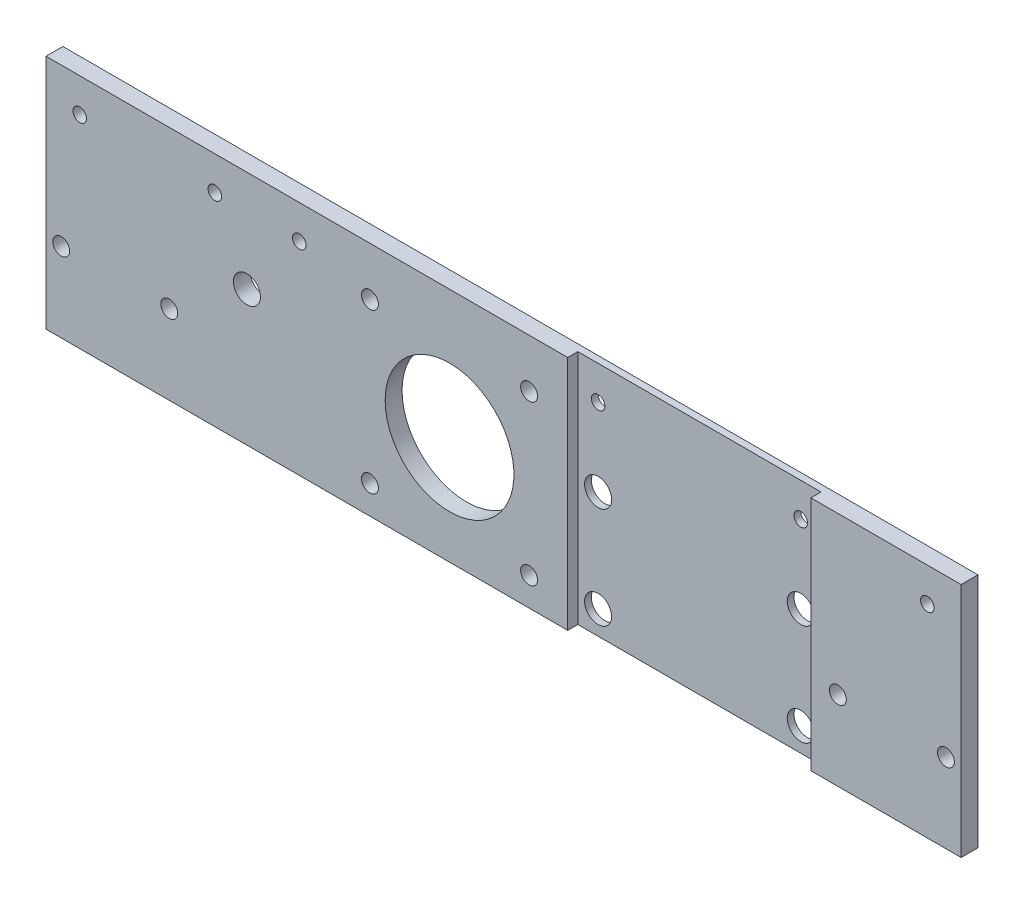
ISO-10303-21;
HEADER;
FILE_DESCRIPTION(('STEP AP214'),'2;1');
FILE_NAME('part.step','',(''),(''),'','','');
FILE_SCHEMA(('AUTOMOTIVE_DESIGN { 1 0 10303 214 1 1 1 1 }'));
ENDSEC;
DATA;
#1=APPLICATION_CONTEXT('core data for automotive mechanical design processes');
#2=APPLICATION_PROTOCOL_DEFINITION('international standard','automotive_design',2000,#1);
#3=PRODUCT_CONTEXT('',#1,'mechanical');
#4=PRODUCT('Part','Part','',(#3));
#5=PRODUCT_RELATED_PRODUCT_CATEGORY('part','',(#4));
#6=PRODUCT_DEFINITION_FORMATION('','',#4);
#7=PRODUCT_DEFINITION_CONTEXT('part definition',#1,'design');
#8=PRODUCT_DEFINITION('design','',#6,#7);
#9=PRODUCT_DEFINITION_SHAPE('','',#8);
#10=(LENGTH_UNIT() NAMED_UNIT(*) SI_UNIT(.MILLI.,.METRE.));
#11=(NAMED_UNIT(*) PLANE_ANGLE_UNIT() SI_UNIT($,.RADIAN.));
#12=(NAMED_UNIT(*) SI_UNIT($,.STERADIAN.) SOLID_ANGLE_UNIT());
#13=UNCERTAINTY_MEASURE_WITH_UNIT(LENGTH_MEASURE(1.E-05),#10,'distance_accuracy_value','');
#14=(GEOMETRIC_REPRESENTATION_CONTEXT(3) GLOBAL_UNCERTAINTY_ASSIGNED_CONTEXT((#13)) GLOBAL_UNIT_ASSIGNED_CONTEXT((#10,
#11,#12)) REPRESENTATION_CONTEXT('',''));
#15=CARTESIAN_POINT('',(0.,0.,0.));
#16=DIRECTION('',(0.,0.,1.));
#17=DIRECTION('',(1.,0.,0.));
#18=AXIS2_PLACEMENT_3D('',#15,#16,#17);
#19=CARTESIAN_POINT('',(0.,0.,5.));
#20=DIRECTION('',(0.,0.,-1.));
#21=DIRECTION('',(-1.,0.,0.));
#22=AXIS2_PLACEMENT_3D('',#19,#20,#21);
#23=PLANE('',#22);
#24=CARTESIAN_POINT('',(75.,60.,5.));
#25=DIRECTION('',(0.,0.,1.));
#26=DIRECTION('',(1.,0.,0.));
#27=AXIS2_PLACEMENT_3D('',#24,#25,#26);
#28=CIRCLE('',#27,2.);
#29=CARTESIAN_POINT('',(77.,60.,5.));
#30=VERTEX_POINT('',#29);
#31=EDGE_CURVE('E378',#30,#30,#28,.T.);
#32=ORIENTED_EDGE('',*,*,#31,.F.);
#33=EDGE_LOOP('',(#32));
#34=FACE_BOUND('',#33,.T.);
#35=CARTESIAN_POINT('',(59.5,40.,5.));
#36=DIRECTION('',(0.,0.,-1.));
#37=DIRECTION('',(-1.,0.,0.));
#38=AXIS2_PLACEMENT_3D('',#35,#36,#37);
#39=CIRCLE('',#38,4.00000000000001);
#40=CARTESIAN_POINT('',(55.5,40.,5.));
#41=VERTEX_POINT('',#40);
#42=EDGE_CURVE('E384',#41,#41,#39,.T.);
#43=ORIENTED_EDGE('',*,*,#42,.T.);
#44=EDGE_LOOP('',(#43));
#45=FACE_BOUND('',#44,.T.);
#46=CARTESIAN_POINT('',(143.07,55.57,5.));
#47=DIRECTION('',(0.,0.,-1.));
#48=DIRECTION('',(-1.,0.,0.));
#49=AXIS2_PLACEMENT_3D('',#46,#47,#48);
#50=CIRCLE('',#49,2.5);
#51=CARTESIAN_POINT('',(140.57,55.57,5.));
#52=VERTEX_POINT('',#51);
#53=EDGE_CURVE('E390',#52,#52,#50,.T.);
#54=ORIENTED_EDGE('',*,*,#53,.T.);
#55=EDGE_LOOP('',(#54));
#56=FACE_BOUND('',#55,.T.);
#57=CARTESIAN_POINT('',(95.93,55.57,5.));
#58=DIRECTION('',(0.,0.,-1.));
#59=DIRECTION('',(-1.,0.,0.));
#60=AXIS2_PLACEMENT_3D('',#57,#58,#59);
#61=CIRCLE('',#60,2.50000000000001);
#62=CARTESIAN_POINT('',(93.43,55.57,5.));
#63=VERTEX_POINT('',#62);
#64=EDGE_CURVE('E396',#63,#63,#61,.T.);
#65=ORIENTED_EDGE('',*,*,#64,.T.);
#66=EDGE_LOOP('',(#65));
#67=FACE_BOUND('',#66,.T.);
#68=CARTESIAN_POINT('',(143.07,8.43,5.));
#69=DIRECTION('',(0.,0.,-1.));
#70=DIRECTION('',(-1.,0.,0.));
#71=AXIS2_PLACEMENT_3D('',#68,#69,#70);
#72=CIRCLE('',#71,2.5);
#73=CARTESIAN_POINT('',(140.57,8.43,5.));
#74=VERTEX_POINT('',#73);
#75=EDGE_CURVE('E402',#74,#74,#72,.T.);
#76=ORIENTED_EDGE('',*,*,#75,.T.);
#77=EDGE_LOOP('',(#76));
#78=FACE_BOUND('',#77,.T.);
#79=CARTESIAN_POINT('',(95.93,8.43,5.));
#80=DIRECTION('',(0.,0.,-1.));
#81=DIRECTION('',(-1.,0.,0.));
#82=AXIS2_PLACEMENT_3D('',#79,#80,#81);
#83=CIRCLE('',#82,2.49999999999999);
#84=CARTESIAN_POINT('',(93.43,8.43,5.));
#85=VERTEX_POINT('',#84);
#86=EDGE_CURVE('E408',#85,#85,#83,.T.);
#87=ORIENTED_EDGE('',*,*,#86,.T.);
#88=EDGE_LOOP('',(#87));
#89=FACE_BOUND('',#88,.T.);
#90=CARTESIAN_POINT('',(119.5,32.,5.));
#91=DIRECTION('',(0.,0.,-1.));
#92=DIRECTION('',(-1.,0.,0.));
#93=AXIS2_PLACEMENT_3D('',#90,#91,#92);
#94=CIRCLE('',#93,19.0625);
#95=CARTESIAN_POINT('',(100.4375,32.,5.));
#96=VERTEX_POINT('',#95);
#97=EDGE_CURVE('E414',#96,#96,#94,.T.);
#98=ORIENTED_EDGE('',*,*,#97,.T.);
#99=EDGE_LOOP('',(#98));
#100=FACE_BOUND('',#99,.T.);
#101=CARTESIAN_POINT('',(50.,60.,5.));
#102=DIRECTION('',(0.,0.,-1.));
#103=DIRECTION('',(-1.,0.,0.));
#104=AXIS2_PLACEMENT_3D('',#101,#102,#103);
#105=CIRCLE('',#104,2.);
#106=CARTESIAN_POINT('',(48.,60.,5.));
#107=VERTEX_POINT('',#106);
#108=EDGE_CURVE('E205',#107,#107,#105,.T.);
#109=ORIENTED_EDGE('',*,*,#108,.T.);
#110=EDGE_LOOP('',(#109));
#111=FACE_BOUND('',#110,.T.);
#112=CARTESIAN_POINT('',(10.,60.,5.));
#113=DIRECTION('',(0.,0.,-1.));
#114=DIRECTION('',(-1.,0.,0.));
#115=AXIS2_PLACEMENT_3D('',#112,#113,#114);
#116=CIRCLE('',#115,2.);
#117=CARTESIAN_POINT('',(8.00000000000001,60.,5.));
#118=VERTEX_POINT('',#117);
#119=EDGE_CURVE('E211',#118,#118,#116,.T.);
#120=ORIENTED_EDGE('',*,*,#119,.T.);
#121=EDGE_LOOP('',(#120));
#122=FACE_BOUND('',#121,.T.);
#123=CARTESIAN_POINT('',(4.5,23.5,5.));
#124=DIRECTION('',(0.,0.,-1.));
#125=DIRECTION('',(-1.,0.,0.));
#126=AXIS2_PLACEMENT_3D('',#123,#124,#125);
#127=CIRCLE('',#126,2.5);
#128=CARTESIAN_POINT('',(2.,23.5,5.));
#129=VERTEX_POINT('',#128);
#130=EDGE_CURVE('E217',#129,#129,#127,.T.);
#131=ORIENTED_EDGE('',*,*,#130,.T.);
#132=EDGE_LOOP('',(#131));
#133=FACE_BOUND('',#132,.T.);
#134=CARTESIAN_POINT('',(36.5,23.5,5.));
#135=DIRECTION('',(0.,0.,-1.));
#136=DIRECTION('',(-1.,0.,0.));
#137=AXIS2_PLACEMENT_3D('',#134,#135,#136);
#138=CIRCLE('',#137,2.5);
#139=CARTESIAN_POINT('',(34.,23.5,5.));
#140=VERTEX_POINT('',#139);
#141=EDGE_CURVE('E223',#140,#140,#138,.T.);
#142=ORIENTED_EDGE('',*,*,#141,.T.);
#143=EDGE_LOOP('',(#142));
#144=FACE_BOUND('',#143,.T.);
#145=DIRECTION('',(1.,0.,0.));
#146=VECTOR('',#145,1.);
#147=CARTESIAN_POINT('',(0.,0.,5.));
#148=LINE('',#147,#146);
#149=CARTESIAN_POINT('',(0.,0.,5.));
#150=VERTEX_POINT('',#149);
#151=CARTESIAN_POINT('',(154.5,0.,5.));
#152=VERTEX_POINT('',#151);
#153=EDGE_CURVE('E88',#150,#152,#148,.T.);
#154=ORIENTED_EDGE('',*,*,#153,.T.);
#155=DIRECTION('',(0.,-1.,0.));
#156=VECTOR('',#155,1.);
#157=CARTESIAN_POINT('',(154.5,70.,5.));
#158=LINE('',#157,#156);
#159=CARTESIAN_POINT('',(154.5,70.,5.));
#160=VERTEX_POINT('',#159);
#161=EDGE_CURVE('E114',#160,#152,#158,.T.);
#162=ORIENTED_EDGE('',*,*,#161,.F.);
#163=DIRECTION('',(-1.,0.,0.));
#164=VECTOR('',#163,1.);
#165=CARTESIAN_POINT('',(0.,70.,5.));
#166=LINE('',#165,#164);
#167=CARTESIAN_POINT('',(0.,70.,5.));
#168=VERTEX_POINT('',#167);
#169=EDGE_CURVE('E59',#160,#168,#166,.T.);
#170=ORIENTED_EDGE('',*,*,#169,.T.);
#171=DIRECTION('',(0.,-1.,0.));
#172=VECTOR('',#171,1.);
#173=CARTESIAN_POINT('',(0.,0.,5.));
#174=LINE('',#173,#172);
#175=EDGE_CURVE('E145',#168,#150,#174,.T.);
#176=ORIENTED_EDGE('',*,*,#175,.T.);
#177=EDGE_LOOP('',(#154,#162,#170,#176));
#178=FACE_BOUND('',#177,.T.);
#179=ADVANCED_FACE('F33',(#34,#45,#56,#67,#78,#89,#100,#111,#122,#133,#144,#178),#23,.F.);
#180=CARTESIAN_POINT('',(0.,0.,5.));
#181=DIRECTION('',(1.,0.,0.));
#182=DIRECTION('',(0.,0.,-1.));
#183=AXIS2_PLACEMENT_3D('',#180,#181,#182);
#184=PLANE('',#183);
#185=DIRECTION('',(0.,-1.,0.));
#186=VECTOR('',#185,1.);
#187=CARTESIAN_POINT('',(0.,0.,0.));
#188=LINE('',#187,#186);
#189=CARTESIAN_POINT('',(0.,70.,0.));
#190=VERTEX_POINT('',#189);
#191=CARTESIAN_POINT('',(0.,0.,0.));
#192=VERTEX_POINT('',#191);
#193=EDGE_CURVE('E140',#190,#192,#188,.T.);
#194=ORIENTED_EDGE('',*,*,#193,.T.);
#195=DIRECTION('',(0.,0.,-1.));
#196=VECTOR('',#195,1.);
#197=CARTESIAN_POINT('',(0.,0.,5.));
#198=LINE('',#197,#196);
#199=EDGE_CURVE('E11',#150,#192,#198,.T.);
#200=ORIENTED_EDGE('',*,*,#199,.F.);
#201=ORIENTED_EDGE('',*,*,#175,.F.);
#202=DIRECTION('',(0.,0.,-1.));
#203=VECTOR('',#202,1.);
#204=CARTESIAN_POINT('',(0.,70.,5.));
#205=LINE('',#204,#203);
#206=EDGE_CURVE('E154',#168,#190,#205,.T.);
#207=ORIENTED_EDGE('',*,*,#206,.T.);
#208=EDGE_LOOP('',(#194,#200,#201,#207));
#209=FACE_BOUND('',#208,.T.);
#210=ADVANCED_FACE('F35',(#209),#184,.F.);
#211=CARTESIAN_POINT('',(0.,0.,5.));
#212=DIRECTION('',(0.,1.,0.));
#213=DIRECTION('',(0.,0.,1.));
#214=AXIS2_PLACEMENT_3D('',#211,#212,#213);
#215=PLANE('',#214);
#216=DIRECTION('',(1.,0.,0.));
#217=VECTOR('',#216,1.);
#218=CARTESIAN_POINT('',(154.5,0.,2.));
#219=LINE('',#218,#217);
#220=CARTESIAN_POINT('',(154.5,0.,2.));
#221=VERTEX_POINT('',#220);
#222=CARTESIAN_POINT('',(226.5,0.,2.));
#223=VERTEX_POINT('',#222);
#224=EDGE_CURVE('E122',#221,#223,#219,.T.);
#225=ORIENTED_EDGE('',*,*,#224,.F.);
#226=DIRECTION('',(0.,0.,1.));
#227=VECTOR('',#226,1.);
#228=CARTESIAN_POINT('',(154.5,0.,2.));
#229=LINE('',#228,#227);
#230=EDGE_CURVE('E109',#221,#152,#229,.T.);
#231=ORIENTED_EDGE('',*,*,#230,.T.);
#232=ORIENTED_EDGE('',*,*,#153,.F.);
#233=ORIENTED_EDGE('',*,*,#199,.T.);
#234=DIRECTION('',(1.,0.,0.));
#235=VECTOR('',#234,1.);
#236=CARTESIAN_POINT('',(0.,0.,0.));
#237=LINE('',#236,#235);
#238=CARTESIAN_POINT('',(271.,0.,0.));
#239=VERTEX_POINT('',#238);
#240=EDGE_CURVE('E157',#192,#239,#237,.T.);
#241=ORIENTED_EDGE('',*,*,#240,.T.);
#242=DIRECTION('',(0.,0.,-1.));
#243=VECTOR('',#242,1.);
#244=CARTESIAN_POINT('',(271.,0.,5.));
#245=LINE('',#244,#243);
#246=CARTESIAN_POINT('',(271.,0.,5.));
#247=VERTEX_POINT('',#246);
#248=EDGE_CURVE('E42',#247,#239,#245,.T.);
#249=ORIENTED_EDGE('',*,*,#248,.F.);
#250=CARTESIAN_POINT('',(226.5,0.,5.));
#251=VERTEX_POINT('',#250);
#252=EDGE_CURVE('E147',#251,#247,#148,.T.);
#253=ORIENTED_EDGE('',*,*,#252,.F.);
#254=DIRECTION('',(0.,0.,1.));
#255=VECTOR('',#254,1.);
#256=CARTESIAN_POINT('',(226.5,0.,2.));
#257=LINE('',#256,#255);
#258=EDGE_CURVE('E50',#223,#251,#257,.T.);
#259=ORIENTED_EDGE('',*,*,#258,.F.);
#260=EDGE_LOOP('',(#225,#231,#232,#233,#241,#249,#253,#259));
#261=FACE_BOUND('',#260,.T.);
#262=ADVANCED_FACE('F127',(#261),#215,.F.);
#263=CARTESIAN_POINT('',(271.,0.,5.));
#264=DIRECTION('',(-1.,0.,0.));
#265=DIRECTION('',(0.,0.,1.));
#266=AXIS2_PLACEMENT_3D('',#263,#264,#265);
#267=PLANE('',#266);
#268=DIRECTION('',(0.,1.,0.));
#269=VECTOR('',#268,1.);
#270=CARTESIAN_POINT('',(271.,0.,0.));
#271=LINE('',#270,#269);
#272=CARTESIAN_POINT('',(271.,70.,0.));
#273=VERTEX_POINT('',#272);
#274=EDGE_CURVE('E159',#239,#273,#271,.T.);
#275=ORIENTED_EDGE('',*,*,#274,.T.);
#276=DIRECTION('',(0.,0.,-1.));
#277=VECTOR('',#276,1.);
#278=CARTESIAN_POINT('',(271.,70.,5.));
#279=LINE('',#278,#277);
#280=CARTESIAN_POINT('',(271.,70.,5.));
#281=VERTEX_POINT('',#280);
#282=EDGE_CURVE('E163',#281,#273,#279,.T.);
#283=ORIENTED_EDGE('',*,*,#282,.F.);
#284=DIRECTION('',(0.,1.,0.));
#285=VECTOR('',#284,1.);
#286=CARTESIAN_POINT('',(271.,0.,5.));
#287=LINE('',#286,#285);
#288=EDGE_CURVE('E149',#247,#281,#287,.T.);
#289=ORIENTED_EDGE('',*,*,#288,.F.);
#290=ORIENTED_EDGE('',*,*,#248,.T.);
#291=EDGE_LOOP('',(#275,#283,#289,#290));
#292=FACE_BOUND('',#291,.T.);
#293=ADVANCED_FACE('F274',(#292),#267,.F.);
#294=CARTESIAN_POINT('',(0.,70.,5.));
#295=DIRECTION('',(0.,-1.,0.));
#296=DIRECTION('',(0.,0.,-1.));
#297=AXIS2_PLACEMENT_3D('',#294,#295,#296);
#298=PLANE('',#297);
#299=ORIENTED_EDGE('',*,*,#169,.F.);
#300=DIRECTION('',(0.,0.,1.));
#301=VECTOR('',#300,1.);
#302=CARTESIAN_POINT('',(154.5,70.,2.));
#303=LINE('',#302,#301);
#304=CARTESIAN_POINT('',(154.5,70.,2.));
#305=VERTEX_POINT('',#304);
#306=EDGE_CURVE('E138',#305,#160,#303,.T.);
#307=ORIENTED_EDGE('',*,*,#306,.F.);
#308=DIRECTION('',(-1.,0.,0.));
#309=VECTOR('',#308,1.);
#310=CARTESIAN_POINT('',(154.5,70.,2.));
#311=LINE('',#310,#309);
#312=CARTESIAN_POINT('',(226.5,70.,2.));
#313=VERTEX_POINT('',#312);
#314=EDGE_CURVE('E116',#313,#305,#311,.T.);
#315=ORIENTED_EDGE('',*,*,#314,.F.);
#316=DIRECTION('',(0.,0.,1.));
#317=VECTOR('',#316,1.);
#318=CARTESIAN_POINT('',(226.5,70.,2.));
#319=LINE('',#318,#317);
#320=CARTESIAN_POINT('',(226.5,70.,5.));
#321=VERTEX_POINT('',#320);
#322=EDGE_CURVE('E141',#313,#321,#319,.T.);
#323=ORIENTED_EDGE('',*,*,#322,.T.);
#324=EDGE_CURVE('E151',#281,#321,#166,.T.);
#325=ORIENTED_EDGE('',*,*,#324,.F.);
#326=ORIENTED_EDGE('',*,*,#282,.T.);
#327=DIRECTION('',(-1.,0.,0.));
#328=VECTOR('',#327,1.);
#329=CARTESIAN_POINT('',(0.,70.,0.));
#330=LINE('',#329,#328);
#331=EDGE_CURVE('E81',#273,#190,#330,.T.);
#332=ORIENTED_EDGE('',*,*,#331,.T.);
#333=ORIENTED_EDGE('',*,*,#206,.F.);
#334=EDGE_LOOP('',(#299,#307,#315,#323,#325,#326,#332,#333));
#335=FACE_BOUND('',#334,.T.);
#336=ADVANCED_FACE('F259',(#335),#298,.F.);
#337=CARTESIAN_POINT('',(261.,60.,5.));
#338=DIRECTION('',(0.,0.,-1.));
#339=DIRECTION('',(-1.,0.,0.));
#340=AXIS2_PLACEMENT_3D('',#337,#338,#339);
#341=CIRCLE('',#340,2.);
#342=CARTESIAN_POINT('',(259.,60.,5.));
#343=VERTEX_POINT('',#342);
#344=EDGE_CURVE('E194',#343,#343,#341,.T.);
#345=ORIENTED_EDGE('',*,*,#344,.T.);
#346=EDGE_LOOP('',(#345));
#347=FACE_BOUND('',#346,.T.);
#348=CARTESIAN_POINT('',(266.5,23.5,5.));
#349=DIRECTION('',(0.,0.,-1.));
#350=DIRECTION('',(-1.,0.,0.));
#351=AXIS2_PLACEMENT_3D('',#348,#349,#350);
#352=CIRCLE('',#351,2.50000000000002);
#353=CARTESIAN_POINT('',(264.,23.5,5.));
#354=VERTEX_POINT('',#353);
#355=EDGE_CURVE('E229',#354,#354,#352,.T.);
#356=ORIENTED_EDGE('',*,*,#355,.T.);
#357=EDGE_LOOP('',(#356));
#358=FACE_BOUND('',#357,.T.);
#359=CARTESIAN_POINT('',(234.5,23.5,5.));
#360=DIRECTION('',(0.,0.,-1.));
#361=DIRECTION('',(-1.,0.,0.));
#362=AXIS2_PLACEMENT_3D('',#359,#360,#361);
#363=CIRCLE('',#362,2.5);
#364=CARTESIAN_POINT('',(232.,23.5,5.));
#365=VERTEX_POINT('',#364);
#366=EDGE_CURVE('E235',#365,#365,#363,.T.);
#367=ORIENTED_EDGE('',*,*,#366,.T.);
#368=EDGE_LOOP('',(#367));
#369=FACE_BOUND('',#368,.T.);
#370=ORIENTED_EDGE('',*,*,#324,.T.);
#371=DIRECTION('',(0.,1.,0.));
#372=VECTOR('',#371,1.);
#373=CARTESIAN_POINT('',(226.5,70.,5.));
#374=LINE('',#373,#372);
#375=EDGE_CURVE('E125',#251,#321,#374,.T.);
#376=ORIENTED_EDGE('',*,*,#375,.F.);
#377=ORIENTED_EDGE('',*,*,#252,.T.);
#378=ORIENTED_EDGE('',*,*,#288,.T.);
#379=EDGE_LOOP('',(#370,#376,#377,#378));
#380=FACE_BOUND('',#379,.T.);
#381=ADVANCED_FACE('F251',(#347,#358,#369,#380),#23,.F.);
#382=CARTESIAN_POINT('',(0.,0.,0.));
#383=DIRECTION('',(0.,0.,-1.));
#384=DIRECTION('',(-1.,0.,0.));
#385=AXIS2_PLACEMENT_3D('',#382,#383,#384);
#386=PLANE('',#385);
#387=CARTESIAN_POINT('',(75.,60.,0.));
#388=DIRECTION('',(0.,0.,-1.));
#389=DIRECTION('',(-1.,0.,0.));
#390=AXIS2_PLACEMENT_3D('',#387,#388,#389);
#391=CIRCLE('',#390,2.);
#392=CARTESIAN_POINT('',(73.,60.,0.));
#393=VERTEX_POINT('',#392);
#394=EDGE_CURVE('E37',#393,#393,#391,.T.);
#395=ORIENTED_EDGE('',*,*,#394,.F.);
#396=EDGE_LOOP('',(#395));
#397=FACE_BOUND('',#396,.T.);
#398=CARTESIAN_POINT('',(59.5,40.,0.));
#399=DIRECTION('',(0.,0.,-1.));
#400=DIRECTION('',(-1.,0.,0.));
#401=AXIS2_PLACEMENT_3D('',#398,#399,#400);
#402=CIRCLE('',#401,4.00000000000001);
#403=CARTESIAN_POINT('',(55.5,40.,0.));
#404=VERTEX_POINT('',#403);
#405=EDGE_CURVE('E380',#404,#404,#402,.T.);
#406=ORIENTED_EDGE('',*,*,#405,.F.);
#407=EDGE_LOOP('',(#406));
#408=FACE_BOUND('',#407,.T.);
#409=CARTESIAN_POINT('',(143.07,55.57,0.));
#410=DIRECTION('',(0.,0.,-1.));
#411=DIRECTION('',(-1.,0.,0.));
#412=AXIS2_PLACEMENT_3D('',#409,#410,#411);
#413=CIRCLE('',#412,2.5);
#414=CARTESIAN_POINT('',(140.57,55.57,0.));
#415=VERTEX_POINT('',#414);
#416=EDGE_CURVE('E387',#415,#415,#413,.T.);
#417=ORIENTED_EDGE('',*,*,#416,.F.);
#418=EDGE_LOOP('',(#417));
#419=FACE_BOUND('',#418,.T.);
#420=CARTESIAN_POINT('',(95.93,55.57,0.));
#421=DIRECTION('',(0.,0.,-1.));
#422=DIRECTION('',(-1.,0.,0.));
#423=AXIS2_PLACEMENT_3D('',#420,#421,#422);
#424=CIRCLE('',#423,2.50000000000001);
#425=CARTESIAN_POINT('',(93.43,55.57,0.));
#426=VERTEX_POINT('',#425);
#427=EDGE_CURVE('E393',#426,#426,#424,.T.);
#428=ORIENTED_EDGE('',*,*,#427,.F.);
#429=EDGE_LOOP('',(#428));
#430=FACE_BOUND('',#429,.T.);
#431=CARTESIAN_POINT('',(143.07,8.43,0.));
#432=DIRECTION('',(0.,0.,-1.));
#433=DIRECTION('',(-1.,0.,0.));
#434=AXIS2_PLACEMENT_3D('',#431,#432,#433);
#435=CIRCLE('',#434,2.5);
#436=CARTESIAN_POINT('',(140.57,8.43,0.));
#437=VERTEX_POINT('',#436);
#438=EDGE_CURVE('E399',#437,#437,#435,.T.);
#439=ORIENTED_EDGE('',*,*,#438,.F.);
#440=EDGE_LOOP('',(#439));
#441=FACE_BOUND('',#440,.T.);
#442=CARTESIAN_POINT('',(95.93,8.43,0.));
#443=DIRECTION('',(0.,0.,-1.));
#444=DIRECTION('',(-1.,0.,0.));
#445=AXIS2_PLACEMENT_3D('',#442,#443,#444);
#446=CIRCLE('',#445,2.49999999999999);
#447=CARTESIAN_POINT('',(93.43,8.43,0.));
#448=VERTEX_POINT('',#447);
#449=EDGE_CURVE('E405',#448,#448,#446,.T.);
#450=ORIENTED_EDGE('',*,*,#449,.F.);
#451=EDGE_LOOP('',(#450));
#452=FACE_BOUND('',#451,.T.);
#453=CARTESIAN_POINT('',(119.5,32.,0.));
#454=DIRECTION('',(0.,0.,-1.));
#455=DIRECTION('',(-1.,0.,0.));
#456=AXIS2_PLACEMENT_3D('',#453,#454,#455);
#457=CIRCLE('',#456,19.0625);
#458=CARTESIAN_POINT('',(100.4375,32.,0.));
#459=VERTEX_POINT('',#458);
#460=EDGE_CURVE('E411',#459,#459,#457,.T.);
#461=ORIENTED_EDGE('',*,*,#460,.F.);
#462=EDGE_LOOP('',(#461));
#463=FACE_BOUND('',#462,.T.);
#464=CARTESIAN_POINT('',(261.,60.,0.));
#465=DIRECTION('',(0.,0.,-1.));
#466=DIRECTION('',(-1.,0.,0.));
#467=AXIS2_PLACEMENT_3D('',#464,#465,#466);
#468=CIRCLE('',#467,2.);
#469=CARTESIAN_POINT('',(259.,60.,0.));
#470=VERTEX_POINT('',#469);
#471=EDGE_CURVE('E199',#470,#470,#468,.T.);
#472=ORIENTED_EDGE('',*,*,#471,.F.);
#473=EDGE_LOOP('',(#472));
#474=FACE_BOUND('',#473,.T.);
#475=CARTESIAN_POINT('',(220.5,60.,0.));
#476=DIRECTION('',(0.,0.,-1.));
#477=DIRECTION('',(-1.,0.,0.));
#478=AXIS2_PLACEMENT_3D('',#475,#476,#477);
#479=CIRCLE('',#478,2.);
#480=CARTESIAN_POINT('',(218.5,60.,0.));
#481=VERTEX_POINT('',#480);
#482=EDGE_CURVE('E188',#481,#481,#479,.T.);
#483=ORIENTED_EDGE('',*,*,#482,.F.);
#484=EDGE_LOOP('',(#483));
#485=FACE_BOUND('',#484,.T.);
#486=CARTESIAN_POINT('',(160.5,60.,0.));
#487=DIRECTION('',(0.,0.,-1.));
#488=DIRECTION('',(-1.,0.,0.));
#489=AXIS2_PLACEMENT_3D('',#486,#487,#488);
#490=CIRCLE('',#489,2.);
#491=CARTESIAN_POINT('',(158.5,60.,0.));
#492=VERTEX_POINT('',#491);
#493=EDGE_CURVE('E185',#492,#492,#490,.T.);
#494=ORIENTED_EDGE('',*,*,#493,.F.);
#495=EDGE_LOOP('',(#494));
#496=FACE_BOUND('',#495,.T.);
#497=CARTESIAN_POINT('',(50.,60.,0.));
#498=DIRECTION('',(0.,0.,-1.));
#499=DIRECTION('',(-1.,0.,0.));
#500=AXIS2_PLACEMENT_3D('',#497,#498,#499);
#501=CIRCLE('',#500,2.);
#502=CARTESIAN_POINT('',(48.,60.,0.));
#503=VERTEX_POINT('',#502);
#504=EDGE_CURVE('E184',#503,#503,#501,.T.);
#505=ORIENTED_EDGE('',*,*,#504,.F.);
#506=EDGE_LOOP('',(#505));
#507=FACE_BOUND('',#506,.T.);
#508=CARTESIAN_POINT('',(10.,60.,0.));
#509=DIRECTION('',(0.,0.,-1.));
#510=DIRECTION('',(-1.,0.,0.));
#511=AXIS2_PLACEMENT_3D('',#508,#509,#510);
#512=CIRCLE('',#511,2.);
#513=CARTESIAN_POINT('',(8.00000000000001,60.,0.));
#514=VERTEX_POINT('',#513);
#515=EDGE_CURVE('E208',#514,#514,#512,.T.);
#516=ORIENTED_EDGE('',*,*,#515,.F.);
#517=EDGE_LOOP('',(#516));
#518=FACE_BOUND('',#517,.T.);
#519=CARTESIAN_POINT('',(4.5,23.5,0.));
#520=DIRECTION('',(0.,0.,-1.));
#521=DIRECTION('',(-1.,0.,0.));
#522=AXIS2_PLACEMENT_3D('',#519,#520,#521);
#523=CIRCLE('',#522,2.5);
#524=CARTESIAN_POINT('',(2.,23.5,0.));
#525=VERTEX_POINT('',#524);
#526=EDGE_CURVE('E214',#525,#525,#523,.T.);
#527=ORIENTED_EDGE('',*,*,#526,.F.);
#528=EDGE_LOOP('',(#527));
#529=FACE_BOUND('',#528,.T.);
#530=CARTESIAN_POINT('',(36.5,23.5,0.));
#531=DIRECTION('',(0.,0.,-1.));
#532=DIRECTION('',(-1.,0.,0.));
#533=AXIS2_PLACEMENT_3D('',#530,#531,#532);
#534=CIRCLE('',#533,2.5);
#535=CARTESIAN_POINT('',(34.,23.5,0.));
#536=VERTEX_POINT('',#535);
#537=EDGE_CURVE('E220',#536,#536,#534,.T.);
#538=ORIENTED_EDGE('',*,*,#537,.F.);
#539=EDGE_LOOP('',(#538));
#540=FACE_BOUND('',#539,.T.);
#541=CARTESIAN_POINT('',(266.5,23.5,0.));
#542=DIRECTION('',(0.,0.,-1.));
#543=DIRECTION('',(-1.,0.,0.));
#544=AXIS2_PLACEMENT_3D('',#541,#542,#543);
#545=CIRCLE('',#544,2.50000000000002);
#546=CARTESIAN_POINT('',(264.,23.5,0.));
#547=VERTEX_POINT('',#546);
#548=EDGE_CURVE('E226',#547,#547,#545,.T.);
#549=ORIENTED_EDGE('',*,*,#548,.F.);
#550=EDGE_LOOP('',(#549));
#551=FACE_BOUND('',#550,.T.);
#552=CARTESIAN_POINT('',(234.5,23.5,0.));
#553=DIRECTION('',(0.,0.,-1.));
#554=DIRECTION('',(-1.,0.,0.));
#555=AXIS2_PLACEMENT_3D('',#552,#553,#554);
#556=CIRCLE('',#555,2.5);
#557=CARTESIAN_POINT('',(232.,23.5,0.));
#558=VERTEX_POINT('',#557);
#559=EDGE_CURVE('E232',#558,#558,#556,.T.);
#560=ORIENTED_EDGE('',*,*,#559,.F.);
#561=EDGE_LOOP('',(#560));
#562=FACE_BOUND('',#561,.T.);
#563=CARTESIAN_POINT('',(160.5,7.,0.));
#564=DIRECTION('',(0.,0.,-1.));
#565=DIRECTION('',(-1.,0.,0.));
#566=AXIS2_PLACEMENT_3D('',#563,#564,#565);
#567=CIRCLE('',#566,3.99999999999999);
#568=CARTESIAN_POINT('',(156.5,7.,0.));
#569=VERTEX_POINT('',#568);
#570=EDGE_CURVE('E181',#569,#569,#567,.T.);
#571=ORIENTED_EDGE('',*,*,#570,.F.);
#572=EDGE_LOOP('',(#571));
#573=FACE_BOUND('',#572,.T.);
#574=CARTESIAN_POINT('',(220.5,7.,0.));
#575=DIRECTION('',(0.,0.,-1.));
#576=DIRECTION('',(-1.,0.,0.));
#577=AXIS2_PLACEMENT_3D('',#574,#575,#576);
#578=CIRCLE('',#577,3.99999999999999);
#579=CARTESIAN_POINT('',(216.5,7.,0.));
#580=VERTEX_POINT('',#579);
#581=EDGE_CURVE('E177',#580,#580,#578,.T.);
#582=ORIENTED_EDGE('',*,*,#581,.F.);
#583=EDGE_LOOP('',(#582));
#584=FACE_BOUND('',#583,.T.);
#585=CARTESIAN_POINT('',(220.5,37.,0.));
#586=DIRECTION('',(0.,0.,-1.));
#587=DIRECTION('',(-1.,0.,0.));
#588=AXIS2_PLACEMENT_3D('',#585,#586,#587);
#589=CIRCLE('',#588,3.99999999999999);
#590=CARTESIAN_POINT('',(216.5,37.,0.));
#591=VERTEX_POINT('',#590);
#592=EDGE_CURVE('E173',#591,#591,#589,.T.);
#593=ORIENTED_EDGE('',*,*,#592,.F.);
#594=EDGE_LOOP('',(#593));
#595=FACE_BOUND('',#594,.T.);
#596=CARTESIAN_POINT('',(160.5,37.,0.));
#597=DIRECTION('',(0.,0.,-1.));
#598=DIRECTION('',(-1.,0.,0.));
#599=AXIS2_PLACEMENT_3D('',#596,#597,#598);
#600=CIRCLE('',#599,3.99999999999999);
#601=CARTESIAN_POINT('',(156.5,37.,0.));
#602=VERTEX_POINT('',#601);
#603=EDGE_CURVE('E169',#602,#602,#600,.T.);
#604=ORIENTED_EDGE('',*,*,#603,.F.);
#605=EDGE_LOOP('',(#604));
#606=FACE_BOUND('',#605,.T.);
#607=ORIENTED_EDGE('',*,*,#193,.F.);
#608=ORIENTED_EDGE('',*,*,#331,.F.);
#609=ORIENTED_EDGE('',*,*,#274,.F.);
#610=ORIENTED_EDGE('',*,*,#240,.F.);
#611=EDGE_LOOP('',(#607,#608,#609,#610));
#612=FACE_BOUND('',#611,.T.);
#613=ADVANCED_FACE('F248',(#397,#408,#419,#430,#441,#452,#463,#474,#485,#496,#507,#518,#529,
#540,#551,#562,#573,#584,#595,#606,#612),#386,.T.);
#614=CARTESIAN_POINT('',(154.5,70.,2.));
#615=DIRECTION('',(-1.,0.,0.));
#616=DIRECTION('',(0.,0.,1.));
#617=AXIS2_PLACEMENT_3D('',#614,#615,#616);
#618=PLANE('',#617);
#619=ORIENTED_EDGE('',*,*,#161,.T.);
#620=ORIENTED_EDGE('',*,*,#230,.F.);
#621=DIRECTION('',(0.,-1.,0.));
#622=VECTOR('',#621,1.);
#623=CARTESIAN_POINT('',(154.5,70.,2.));
#624=LINE('',#623,#622);
#625=EDGE_CURVE('E112',#305,#221,#624,.T.);
#626=ORIENTED_EDGE('',*,*,#625,.F.);
#627=ORIENTED_EDGE('',*,*,#306,.T.);
#628=EDGE_LOOP('',(#619,#620,#626,#627));
#629=FACE_BOUND('',#628,.T.);
#630=ADVANCED_FACE('F111',(#629),#618,.F.);
#631=CARTESIAN_POINT('',(226.5,70.,2.));
#632=DIRECTION('',(1.,0.,0.));
#633=DIRECTION('',(0.,0.,-1.));
#634=AXIS2_PLACEMENT_3D('',#631,#632,#633);
#635=PLANE('',#634);
#636=ORIENTED_EDGE('',*,*,#375,.T.);
#637=ORIENTED_EDGE('',*,*,#322,.F.);
#638=DIRECTION('',(0.,1.,0.));
#639=VECTOR('',#638,1.);
#640=CARTESIAN_POINT('',(226.5,70.,2.));
#641=LINE('',#640,#639);
#642=EDGE_CURVE('E129',#223,#313,#641,.T.);
#643=ORIENTED_EDGE('',*,*,#642,.F.);
#644=ORIENTED_EDGE('',*,*,#258,.T.);
#645=EDGE_LOOP('',(#636,#637,#643,#644));
#646=FACE_BOUND('',#645,.T.);
#647=ADVANCED_FACE('F285',(#646),#635,.F.);
#648=CARTESIAN_POINT('',(0.,0.,2.));
#649=DIRECTION('',(0.,0.,1.));
#650=DIRECTION('',(1.,0.,0.));
#651=AXIS2_PLACEMENT_3D('',#648,#649,#650);
#652=PLANE('',#651);
#653=CARTESIAN_POINT('',(220.5,60.,2.));
#654=DIRECTION('',(0.,0.,1.));
#655=DIRECTION('',(1.,0.,0.));
#656=AXIS2_PLACEMENT_3D('',#653,#654,#655);
#657=CIRCLE('',#656,2.);
#658=CARTESIAN_POINT('',(222.5,60.,2.));
#659=VERTEX_POINT('',#658);
#660=EDGE_CURVE('E186',#659,#659,#657,.T.);
#661=ORIENTED_EDGE('',*,*,#660,.F.);
#662=EDGE_LOOP('',(#661));
#663=FACE_BOUND('',#662,.T.);
#664=CARTESIAN_POINT('',(160.5,60.,2.));
#665=DIRECTION('',(0.,0.,1.));
#666=DIRECTION('',(1.,0.,0.));
#667=AXIS2_PLACEMENT_3D('',#664,#665,#666);
#668=CIRCLE('',#667,2.);
#669=CARTESIAN_POINT('',(162.5,60.,2.));
#670=VERTEX_POINT('',#669);
#671=EDGE_CURVE('E182',#670,#670,#668,.T.);
#672=ORIENTED_EDGE('',*,*,#671,.F.);
#673=EDGE_LOOP('',(#672));
#674=FACE_BOUND('',#673,.T.);
#675=CARTESIAN_POINT('',(160.5,7.,2.));
#676=DIRECTION('',(0.,0.,1.));
#677=DIRECTION('',(1.,0.,0.));
#678=AXIS2_PLACEMENT_3D('',#675,#676,#677);
#679=CIRCLE('',#678,3.99999999999999);
#680=CARTESIAN_POINT('',(164.5,7.,2.));
#681=VERTEX_POINT('',#680);
#682=EDGE_CURVE('E178',#681,#681,#679,.T.);
#683=ORIENTED_EDGE('',*,*,#682,.F.);
#684=EDGE_LOOP('',(#683));
#685=FACE_BOUND('',#684,.T.);
#686=CARTESIAN_POINT('',(220.5,7.,2.));
#687=DIRECTION('',(0.,0.,1.));
#688=DIRECTION('',(1.,0.,0.));
#689=AXIS2_PLACEMENT_3D('',#686,#687,#688);
#690=CIRCLE('',#689,3.99999999999999);
#691=CARTESIAN_POINT('',(224.5,7.,2.));
#692=VERTEX_POINT('',#691);
#693=EDGE_CURVE('E174',#692,#692,#690,.T.);
#694=ORIENTED_EDGE('',*,*,#693,.F.);
#695=EDGE_LOOP('',(#694));
#696=FACE_BOUND('',#695,.T.);
#697=CARTESIAN_POINT('',(220.5,37.,2.));
#698=DIRECTION('',(0.,0.,1.));
#699=DIRECTION('',(1.,0.,0.));
#700=AXIS2_PLACEMENT_3D('',#697,#698,#699);
#701=CIRCLE('',#700,3.99999999999999);
#702=CARTESIAN_POINT('',(224.5,37.,2.));
#703=VERTEX_POINT('',#702);
#704=EDGE_CURVE('E170',#703,#703,#701,.T.);
#705=ORIENTED_EDGE('',*,*,#704,.F.);
#706=EDGE_LOOP('',(#705));
#707=FACE_BOUND('',#706,.T.);
#708=CARTESIAN_POINT('',(160.5,37.,2.));
#709=DIRECTION('',(0.,0.,1.));
#710=DIRECTION('',(1.,0.,0.));
#711=AXIS2_PLACEMENT_3D('',#708,#709,#710);
#712=CIRCLE('',#711,3.99999999999999);
#713=CARTESIAN_POINT('',(164.5,37.,2.));
#714=VERTEX_POINT('',#713);
#715=EDGE_CURVE('E136',#714,#714,#712,.T.);
#716=ORIENTED_EDGE('',*,*,#715,.F.);
#717=EDGE_LOOP('',(#716));
#718=FACE_BOUND('',#717,.T.);
#719=ORIENTED_EDGE('',*,*,#625,.T.);
#720=ORIENTED_EDGE('',*,*,#224,.T.);
#721=ORIENTED_EDGE('',*,*,#642,.T.);
#722=ORIENTED_EDGE('',*,*,#314,.T.);
#723=EDGE_LOOP('',(#719,#720,#721,#722));
#724=FACE_BOUND('',#723,.T.);
#725=ADVANCED_FACE('F120',(#663,#674,#685,#696,#707,#718,#724),#652,.T.);
#726=CARTESIAN_POINT('',(160.5,37.,10.));
#727=DIRECTION('',(0.,0.,-1.));
#728=DIRECTION('',(-1.,0.,0.));
#729=AXIS2_PLACEMENT_3D('',#726,#727,#728);
#730=CYLINDRICAL_SURFACE('',#729,3.99999999999999);
#731=ORIENTED_EDGE('',*,*,#715,.T.);
#732=EDGE_LOOP('',(#731));
#733=FACE_BOUND('',#732,.T.);
#734=ORIENTED_EDGE('',*,*,#603,.T.);
#735=EDGE_LOOP('',(#734));
#736=FACE_BOUND('',#735,.T.);
#737=ADVANCED_FACE('F246',(#733,#736),#730,.F.);
#738=CARTESIAN_POINT('',(220.5,37.,10.));
#739=DIRECTION('',(0.,0.,-1.));
#740=DIRECTION('',(-1.,0.,0.));
#741=AXIS2_PLACEMENT_3D('',#738,#739,#740);
#742=CYLINDRICAL_SURFACE('',#741,3.99999999999999);
#743=ORIENTED_EDGE('',*,*,#704,.T.);
#744=EDGE_LOOP('',(#743));
#745=FACE_BOUND('',#744,.T.);
#746=ORIENTED_EDGE('',*,*,#592,.T.);
#747=EDGE_LOOP('',(#746));
#748=FACE_BOUND('',#747,.T.);
#749=ADVANCED_FACE('F297',(#745,#748),#742,.F.);
#750=CARTESIAN_POINT('',(220.5,7.,10.));
#751=DIRECTION('',(0.,0.,-1.));
#752=DIRECTION('',(-1.,0.,0.));
#753=AXIS2_PLACEMENT_3D('',#750,#751,#752);
#754=CYLINDRICAL_SURFACE('',#753,3.99999999999999);
#755=ORIENTED_EDGE('',*,*,#693,.T.);
#756=EDGE_LOOP('',(#755));
#757=FACE_BOUND('',#756,.T.);
#758=ORIENTED_EDGE('',*,*,#581,.T.);
#759=EDGE_LOOP('',(#758));
#760=FACE_BOUND('',#759,.T.);
#761=ADVANCED_FACE('F301',(#757,#760),#754,.F.);
#762=CARTESIAN_POINT('',(160.5,7.,10.));
#763=DIRECTION('',(0.,0.,-1.));
#764=DIRECTION('',(-1.,0.,0.));
#765=AXIS2_PLACEMENT_3D('',#762,#763,#764);
#766=CYLINDRICAL_SURFACE('',#765,3.99999999999999);
#767=ORIENTED_EDGE('',*,*,#682,.T.);
#768=EDGE_LOOP('',(#767));
#769=FACE_BOUND('',#768,.T.);
#770=ORIENTED_EDGE('',*,*,#570,.T.);
#771=EDGE_LOOP('',(#770));
#772=FACE_BOUND('',#771,.T.);
#773=ADVANCED_FACE('F305',(#769,#772),#766,.F.);
#774=CARTESIAN_POINT('',(234.5,23.5,10.));
#775=DIRECTION('',(0.,0.,-1.));
#776=DIRECTION('',(-1.,0.,0.));
#777=AXIS2_PLACEMENT_3D('',#774,#775,#776);
#778=CYLINDRICAL_SURFACE('',#777,2.5);
#779=ORIENTED_EDGE('',*,*,#559,.T.);
#780=EDGE_LOOP('',(#779));
#781=FACE_BOUND('',#780,.T.);
#782=ORIENTED_EDGE('',*,*,#366,.F.);
#783=EDGE_LOOP('',(#782));
#784=FACE_BOUND('',#783,.T.);
#785=ADVANCED_FACE('F309',(#781,#784),#778,.F.);
#786=CARTESIAN_POINT('',(266.5,23.5,10.));
#787=DIRECTION('',(0.,0.,-1.));
#788=DIRECTION('',(-1.,0.,0.));
#789=AXIS2_PLACEMENT_3D('',#786,#787,#788);
#790=CYLINDRICAL_SURFACE('',#789,2.50000000000002);
#791=ORIENTED_EDGE('',*,*,#548,.T.);
#792=EDGE_LOOP('',(#791));
#793=FACE_BOUND('',#792,.T.);
#794=ORIENTED_EDGE('',*,*,#355,.F.);
#795=EDGE_LOOP('',(#794));
#796=FACE_BOUND('',#795,.T.);
#797=ADVANCED_FACE('F313',(#793,#796),#790,.F.);
#798=CARTESIAN_POINT('',(36.5,23.5,10.));
#799=DIRECTION('',(0.,0.,-1.));
#800=DIRECTION('',(-1.,0.,0.));
#801=AXIS2_PLACEMENT_3D('',#798,#799,#800);
#802=CYLINDRICAL_SURFACE('',#801,2.5);
#803=ORIENTED_EDGE('',*,*,#537,.T.);
#804=EDGE_LOOP('',(#803));
#805=FACE_BOUND('',#804,.T.);
#806=ORIENTED_EDGE('',*,*,#141,.F.);
#807=EDGE_LOOP('',(#806));
#808=FACE_BOUND('',#807,.T.);
#809=ADVANCED_FACE('F317',(#805,#808),#802,.F.);
#810=CARTESIAN_POINT('',(4.5,23.5,10.));
#811=DIRECTION('',(0.,0.,-1.));
#812=DIRECTION('',(-1.,0.,0.));
#813=AXIS2_PLACEMENT_3D('',#810,#811,#812);
#814=CYLINDRICAL_SURFACE('',#813,2.5);
#815=ORIENTED_EDGE('',*,*,#526,.T.);
#816=EDGE_LOOP('',(#815));
#817=FACE_BOUND('',#816,.T.);
#818=ORIENTED_EDGE('',*,*,#130,.F.);
#819=EDGE_LOOP('',(#818));
#820=FACE_BOUND('',#819,.T.);
#821=ADVANCED_FACE('F321',(#817,#820),#814,.F.);
#822=CARTESIAN_POINT('',(10.,60.,10.));
#823=DIRECTION('',(0.,0.,-1.));
#824=DIRECTION('',(-1.,0.,0.));
#825=AXIS2_PLACEMENT_3D('',#822,#823,#824);
#826=CYLINDRICAL_SURFACE('',#825,2.);
#827=ORIENTED_EDGE('',*,*,#515,.T.);
#828=EDGE_LOOP('',(#827));
#829=FACE_BOUND('',#828,.T.);
#830=ORIENTED_EDGE('',*,*,#119,.F.);
#831=EDGE_LOOP('',(#830));
#832=FACE_BOUND('',#831,.T.);
#833=ADVANCED_FACE('F325',(#829,#832),#826,.F.);
#834=CARTESIAN_POINT('',(50.,60.,10.));
#835=DIRECTION('',(0.,0.,-1.));
#836=DIRECTION('',(-1.,0.,0.));
#837=AXIS2_PLACEMENT_3D('',#834,#835,#836);
#838=CYLINDRICAL_SURFACE('',#837,2.);
#839=ORIENTED_EDGE('',*,*,#504,.T.);
#840=EDGE_LOOP('',(#839));
#841=FACE_BOUND('',#840,.T.);
#842=ORIENTED_EDGE('',*,*,#108,.F.);
#843=EDGE_LOOP('',(#842));
#844=FACE_BOUND('',#843,.T.);
#845=ADVANCED_FACE('F329',(#841,#844),#838,.F.);
#846=CARTESIAN_POINT('',(160.5,60.,10.));
#847=DIRECTION('',(0.,0.,-1.));
#848=DIRECTION('',(-1.,0.,0.));
#849=AXIS2_PLACEMENT_3D('',#846,#847,#848);
#850=CYLINDRICAL_SURFACE('',#849,2.);
#851=ORIENTED_EDGE('',*,*,#671,.T.);
#852=EDGE_LOOP('',(#851));
#853=FACE_BOUND('',#852,.T.);
#854=ORIENTED_EDGE('',*,*,#493,.T.);
#855=EDGE_LOOP('',(#854));
#856=FACE_BOUND('',#855,.T.);
#857=ADVANCED_FACE('F333',(#853,#856),#850,.F.);
#858=CARTESIAN_POINT('',(220.5,60.,10.));
#859=DIRECTION('',(0.,0.,-1.));
#860=DIRECTION('',(-1.,0.,0.));
#861=AXIS2_PLACEMENT_3D('',#858,#859,#860);
#862=CYLINDRICAL_SURFACE('',#861,2.);
#863=ORIENTED_EDGE('',*,*,#660,.T.);
#864=EDGE_LOOP('',(#863));
#865=FACE_BOUND('',#864,.T.);
#866=ORIENTED_EDGE('',*,*,#482,.T.);
#867=EDGE_LOOP('',(#866));
#868=FACE_BOUND('',#867,.T.);
#869=ADVANCED_FACE('F337',(#865,#868),#862,.F.);
#870=CARTESIAN_POINT('',(261.,60.,10.));
#871=DIRECTION('',(0.,0.,-1.));
#872=DIRECTION('',(-1.,0.,0.));
#873=AXIS2_PLACEMENT_3D('',#870,#871,#872);
#874=CYLINDRICAL_SURFACE('',#873,2.);
#875=ORIENTED_EDGE('',*,*,#471,.T.);
#876=EDGE_LOOP('',(#875));
#877=FACE_BOUND('',#876,.T.);
#878=ORIENTED_EDGE('',*,*,#344,.F.);
#879=EDGE_LOOP('',(#878));
#880=FACE_BOUND('',#879,.T.);
#881=ADVANCED_FACE('F341',(#877,#880),#874,.F.);
#882=CARTESIAN_POINT('',(119.5,32.,10.));
#883=DIRECTION('',(0.,0.,-1.));
#884=DIRECTION('',(-1.,0.,0.));
#885=AXIS2_PLACEMENT_3D('',#882,#883,#884);
#886=CYLINDRICAL_SURFACE('',#885,19.0625);
#887=ORIENTED_EDGE('',*,*,#460,.T.);
#888=EDGE_LOOP('',(#887));
#889=FACE_BOUND('',#888,.T.);
#890=ORIENTED_EDGE('',*,*,#97,.F.);
#891=EDGE_LOOP('',(#890));
#892=FACE_BOUND('',#891,.T.);
#893=ADVANCED_FACE('F344',(#889,#892),#886,.F.);
#894=CARTESIAN_POINT('',(95.93,8.43,10.));
#895=DIRECTION('',(0.,0.,-1.));
#896=DIRECTION('',(-1.,0.,0.));
#897=AXIS2_PLACEMENT_3D('',#894,#895,#896);
#898=CYLINDRICAL_SURFACE('',#897,2.49999999999999);
#899=ORIENTED_EDGE('',*,*,#449,.T.);
#900=EDGE_LOOP('',(#899));
#901=FACE_BOUND('',#900,.T.);
#902=ORIENTED_EDGE('',*,*,#86,.F.);
#903=EDGE_LOOP('',(#902));
#904=FACE_BOUND('',#903,.T.);
#905=ADVANCED_FACE('F348',(#901,#904),#898,.F.);
#906=CARTESIAN_POINT('',(143.07,8.43,10.));
#907=DIRECTION('',(0.,0.,-1.));
#908=DIRECTION('',(-1.,0.,0.));
#909=AXIS2_PLACEMENT_3D('',#906,#907,#908);
#910=CYLINDRICAL_SURFACE('',#909,2.5);
#911=ORIENTED_EDGE('',*,*,#438,.T.);
#912=EDGE_LOOP('',(#911));
#913=FACE_BOUND('',#912,.T.);
#914=ORIENTED_EDGE('',*,*,#75,.F.);
#915=EDGE_LOOP('',(#914));
#916=FACE_BOUND('',#915,.T.);
#917=ADVANCED_FACE('F352',(#913,#916),#910,.F.);
#918=CARTESIAN_POINT('',(95.93,55.57,10.));
#919=DIRECTION('',(0.,0.,-1.));
#920=DIRECTION('',(-1.,0.,0.));
#921=AXIS2_PLACEMENT_3D('',#918,#919,#920);
#922=CYLINDRICAL_SURFACE('',#921,2.50000000000001);
#923=ORIENTED_EDGE('',*,*,#427,.T.);
#924=EDGE_LOOP('',(#923));
#925=FACE_BOUND('',#924,.T.);
#926=ORIENTED_EDGE('',*,*,#64,.F.);
#927=EDGE_LOOP('',(#926));
#928=FACE_BOUND('',#927,.T.);
#929=ADVANCED_FACE('F356',(#925,#928),#922,.F.);
#930=CARTESIAN_POINT('',(143.07,55.57,10.));
#931=DIRECTION('',(0.,0.,-1.));
#932=DIRECTION('',(-1.,0.,0.));
#933=AXIS2_PLACEMENT_3D('',#930,#931,#932);
#934=CYLINDRICAL_SURFACE('',#933,2.5);
#935=ORIENTED_EDGE('',*,*,#416,.T.);
#936=EDGE_LOOP('',(#935));
#937=FACE_BOUND('',#936,.T.);
#938=ORIENTED_EDGE('',*,*,#53,.F.);
#939=EDGE_LOOP('',(#938));
#940=FACE_BOUND('',#939,.T.);
#941=ADVANCED_FACE('F360',(#937,#940),#934,.F.);
#942=CARTESIAN_POINT('',(59.5,40.,10.));
#943=DIRECTION('',(0.,0.,-1.));
#944=DIRECTION('',(-1.,0.,0.));
#945=AXIS2_PLACEMENT_3D('',#942,#943,#944);
#946=CYLINDRICAL_SURFACE('',#945,4.00000000000001);
#947=ORIENTED_EDGE('',*,*,#405,.T.);
#948=EDGE_LOOP('',(#947));
#949=FACE_BOUND('',#948,.T.);
#950=ORIENTED_EDGE('',*,*,#42,.F.);
#951=EDGE_LOOP('',(#950));
#952=FACE_BOUND('',#951,.T.);
#953=ADVANCED_FACE('F364',(#949,#952),#946,.F.);
#954=CARTESIAN_POINT('',(75.,60.,-5.));
#955=DIRECTION('',(0.,0.,1.));
#956=DIRECTION('',(1.,0.,0.));
#957=AXIS2_PLACEMENT_3D('',#954,#955,#956);
#958=CYLINDRICAL_SURFACE('',#957,2.);
#959=ORIENTED_EDGE('',*,*,#394,.T.);
#960=EDGE_LOOP('',(#959));
#961=FACE_BOUND('',#960,.T.);
#962=ORIENTED_EDGE('',*,*,#31,.T.);
#963=EDGE_LOOP('',(#962));
#964=FACE_BOUND('',#963,.T.);
#965=ADVANCED_FACE('F368',(#961,#964),#958,.F.);
#966=CLOSED_SHELL('',(#179,#210,#262,#293,#336,#381,#613,#630,#647,#725,#737,#749,#761,#773,
#785,#797,#809,#821,#833,#845,#857,#869,#881,#893,#905,#917,#929,#941,#953,#965));
#967=MANIFOLD_SOLID_BREP('B2',#966);
#968=ADVANCED_BREP_SHAPE_REPRESENTATION('',(#18,#967),#14);
#969=SHAPE_DEFINITION_REPRESENTATION(#9,#968);
ENDSEC;
END-ISO-10303-21;
